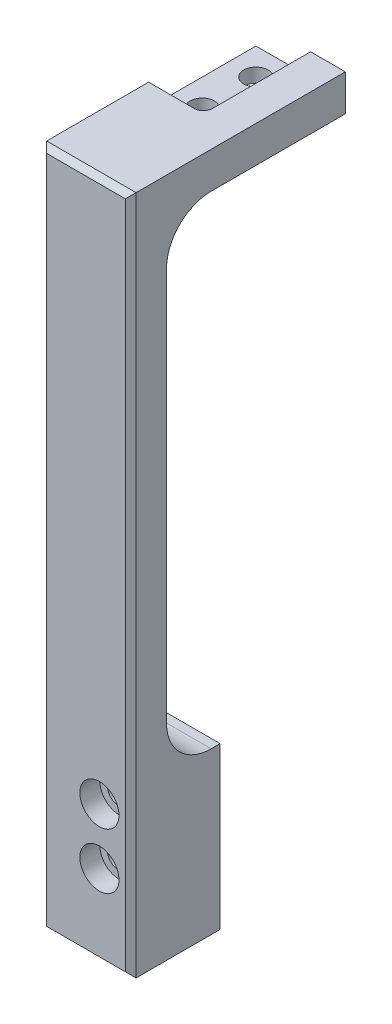
ISO-10303-21;
HEADER;
FILE_DESCRIPTION(('STEP AP214'),'2;1');
FILE_NAME('part.step','',(''),(''),'','','');
FILE_SCHEMA(('AUTOMOTIVE_DESIGN { 1 0 10303 214 1 1 1 1 }'));
ENDSEC;
DATA;
#1=APPLICATION_CONTEXT('core data for automotive mechanical design processes');
#2=APPLICATION_PROTOCOL_DEFINITION('international standard','automotive_design',2000,#1);
#3=PRODUCT_CONTEXT('',#1,'mechanical');
#4=PRODUCT('Part','Part','',(#3));
#5=PRODUCT_RELATED_PRODUCT_CATEGORY('part','',(#4));
#6=PRODUCT_DEFINITION_FORMATION('','',#4);
#7=PRODUCT_DEFINITION_CONTEXT('part definition',#1,'design');
#8=PRODUCT_DEFINITION('design','',#6,#7);
#9=PRODUCT_DEFINITION_SHAPE('','',#8);
#10=(LENGTH_UNIT() NAMED_UNIT(*) SI_UNIT(.MILLI.,.METRE.));
#11=(NAMED_UNIT(*) PLANE_ANGLE_UNIT() SI_UNIT($,.RADIAN.));
#12=(NAMED_UNIT(*) SI_UNIT($,.STERADIAN.) SOLID_ANGLE_UNIT());
#13=UNCERTAINTY_MEASURE_WITH_UNIT(LENGTH_MEASURE(1.E-05),#10,'distance_accuracy_value','');
#14=(GEOMETRIC_REPRESENTATION_CONTEXT(3) GLOBAL_UNCERTAINTY_ASSIGNED_CONTEXT((#13)) GLOBAL_UNIT_ASSIGNED_CONTEXT((#10,
#11,#12)) REPRESENTATION_CONTEXT('',''));
#15=CARTESIAN_POINT('',(0.,0.,0.));
#16=DIRECTION('',(0.,0.,1.));
#17=DIRECTION('',(1.,0.,0.));
#18=AXIS2_PLACEMENT_3D('',#15,#16,#17);
#19=CARTESIAN_POINT('',(3.81,0.,-13.97));
#20=DIRECTION('',(0.,1.,0.));
#21=DIRECTION('',(0.,0.,1.));
#22=AXIS2_PLACEMENT_3D('',#19,#20,#21);
#23=CYLINDRICAL_SURFACE('',#22,1.72719999999999);
#24=CARTESIAN_POINT('',(3.81,-5.16498089039687,-13.97));
#25=DIRECTION('',(0.,1.,0.));
#26=DIRECTION('',(0.,0.,1.));
#27=AXIS2_PLACEMENT_3D('',#24,#25,#26);
#28=CIRCLE('',#27,1.72719999999999);
#29=CARTESIAN_POINT('',(3.81,-5.16498089039687,-12.2428));
#30=VERTEX_POINT('',#29);
#31=EDGE_CURVE('E281',#30,#30,#28,.T.);
#32=ORIENTED_EDGE('',*,*,#31,.F.);
#33=EDGE_LOOP('',(#32));
#34=FACE_BOUND('',#33,.T.);
#35=CARTESIAN_POINT('',(3.81,-3.175,-13.97));
#36=DIRECTION('',(0.,1.,0.));
#37=DIRECTION('',(0.,0.,1.));
#38=AXIS2_PLACEMENT_3D('',#35,#36,#37);
#39=CIRCLE('',#38,1.72719999999999);
#40=CARTESIAN_POINT('',(3.81,-3.175,-12.2428));
#41=VERTEX_POINT('',#40);
#42=EDGE_CURVE('E256',#41,#41,#39,.F.);
#43=ORIENTED_EDGE('',*,*,#42,.F.);
#44=EDGE_LOOP('',(#43));
#45=FACE_BOUND('',#44,.T.);
#46=ADVANCED_FACE('F32',(#34,#45),#23,.F.);
#47=CARTESIAN_POINT('',(3.81,0.,-21.59));
#48=DIRECTION('',(0.,1.,0.));
#49=DIRECTION('',(0.,0.,1.));
#50=AXIS2_PLACEMENT_3D('',#47,#48,#49);
#51=CYLINDRICAL_SURFACE('',#50,1.72719999999999);
#52=CARTESIAN_POINT('',(3.81,-5.16498089039687,-21.59));
#53=DIRECTION('',(0.,1.,0.));
#54=DIRECTION('',(0.,0.,1.));
#55=AXIS2_PLACEMENT_3D('',#52,#53,#54);
#56=CIRCLE('',#55,1.72719999999999);
#57=CARTESIAN_POINT('',(3.81,-5.16498089039687,-19.8628));
#58=VERTEX_POINT('',#57);
#59=EDGE_CURVE('E280',#58,#58,#56,.T.);
#60=ORIENTED_EDGE('',*,*,#59,.F.);
#61=EDGE_LOOP('',(#60));
#62=FACE_BOUND('',#61,.T.);
#63=CARTESIAN_POINT('',(3.81,-3.175,-21.59));
#64=DIRECTION('',(0.,1.,0.));
#65=DIRECTION('',(0.,0.,1.));
#66=AXIS2_PLACEMENT_3D('',#63,#64,#65);
#67=CIRCLE('',#66,1.72719999999999);
#68=CARTESIAN_POINT('',(3.81,-3.175,-19.8628));
#69=VERTEX_POINT('',#68);
#70=EDGE_CURVE('E166',#69,#69,#67,.F.);
#71=ORIENTED_EDGE('',*,*,#70,.F.);
#72=EDGE_LOOP('',(#71));
#73=FACE_BOUND('',#72,.T.);
#74=ADVANCED_FACE('F329',(#62,#73),#51,.F.);
#75=CARTESIAN_POINT('',(0.,-96.5962,0.));
#76=DIRECTION('',(0.,0.,1.));
#77=DIRECTION('',(1.,0.,0.));
#78=AXIS2_PLACEMENT_3D('',#75,#76,#77);
#79=PLANE('',#78);
#80=DIRECTION('',(0.,-1.,0.));
#81=VECTOR('',#80,1.);
#82=CARTESIAN_POINT('',(0.,0.,0.));
#83=LINE('',#82,#81);
#84=CARTESIAN_POINT('',(0.,-11.5149808903969,0.));
#85=VERTEX_POINT('',#84);
#86=CARTESIAN_POINT('',(0.,-67.3862,0.));
#87=VERTEX_POINT('',#86);
#88=EDGE_CURVE('E185',#85,#87,#83,.T.);
#89=ORIENTED_EDGE('',*,*,#88,.F.);
#90=DIRECTION('',(-1.,0.,0.));
#91=VECTOR('',#90,1.);
#92=CARTESIAN_POINT('',(12.7,-11.5149808903969,0.));
#93=LINE('',#92,#91);
#94=CARTESIAN_POINT('',(12.7,-11.5149808903969,0.));
#95=VERTEX_POINT('',#94);
#96=EDGE_CURVE('E197',#85,#95,#93,.F.);
#97=ORIENTED_EDGE('',*,*,#96,.T.);
#98=DIRECTION('',(0.,1.,0.));
#99=VECTOR('',#98,1.);
#100=CARTESIAN_POINT('',(12.7,0.,0.));
#101=LINE('',#100,#99);
#102=CARTESIAN_POINT('',(12.7,-67.3862,0.));
#103=VERTEX_POINT('',#102);
#104=EDGE_CURVE('E189',#103,#95,#101,.T.);
#105=ORIENTED_EDGE('',*,*,#104,.F.);
#106=DIRECTION('',(1.,0.,0.));
#107=VECTOR('',#106,1.);
#108=CARTESIAN_POINT('',(0.,-67.3862,0.));
#109=LINE('',#108,#107);
#110=EDGE_CURVE('E195',#103,#87,#109,.F.);
#111=ORIENTED_EDGE('',*,*,#110,.T.);
#112=EDGE_LOOP('',(#89,#97,#105,#111));
#113=FACE_BOUND('',#112,.T.);
#114=ADVANCED_FACE('F335',(#113),#79,.F.);
#115=CARTESIAN_POINT('',(0.,0.,5.08));
#116=DIRECTION('',(1.,0.,0.));
#117=DIRECTION('',(0.,1.,0.));
#118=AXIS2_PLACEMENT_3D('',#115,#116,#117);
#119=PLANE('',#118);
#120=DIRECTION('',(0.,0.,-1.));
#121=VECTOR('',#120,1.);
#122=CARTESIAN_POINT('',(0.,-96.5962,5.08));
#123=LINE('',#122,#121);
#124=CARTESIAN_POINT('',(0.,-96.5962,4.318));
#125=VERTEX_POINT('',#124);
#126=CARTESIAN_POINT('',(0.,-96.5962,-7.62));
#127=VERTEX_POINT('',#126);
#128=EDGE_CURVE('E312',#125,#127,#123,.T.);
#129=ORIENTED_EDGE('',*,*,#128,.F.);
#130=DIRECTION('',(0.,1.,0.));
#131=VECTOR('',#130,1.);
#132=CARTESIAN_POINT('',(0.,0.,4.318));
#133=LINE('',#132,#131);
#134=CARTESIAN_POINT('',(0.,0.,4.318));
#135=VERTEX_POINT('',#134);
#136=EDGE_CURVE('E219',#125,#135,#133,.T.);
#137=ORIENTED_EDGE('',*,*,#136,.T.);
#138=DIRECTION('',(0.,0.,-1.));
#139=VECTOR('',#138,1.);
#140=CARTESIAN_POINT('',(0.,0.,5.08));
#141=LINE('',#140,#139);
#142=CARTESIAN_POINT('',(0.,0.,-10.16));
#143=VERTEX_POINT('',#142);
#144=EDGE_CURVE('E194',#135,#143,#141,.T.);
#145=ORIENTED_EDGE('',*,*,#144,.T.);
#146=DIRECTION('',(0.,-1.,0.));
#147=VECTOR('',#146,1.);
#148=CARTESIAN_POINT('',(0.,0.,-10.16));
#149=LINE('',#148,#147);
#150=CARTESIAN_POINT('',(0.,-3.175,-10.16));
#151=VERTEX_POINT('',#150);
#152=EDGE_CURVE('E261',#143,#151,#149,.T.);
#153=ORIENTED_EDGE('',*,*,#152,.T.);
#154=DIRECTION('',(0.,0.,1.));
#155=VECTOR('',#154,1.);
#156=CARTESIAN_POINT('',(0.,-3.175,5.08));
#157=LINE('',#156,#155);
#158=CARTESIAN_POINT('',(0.,-3.175,-25.4));
#159=VERTEX_POINT('',#158);
#160=EDGE_CURVE('E259',#159,#151,#157,.T.);
#161=ORIENTED_EDGE('',*,*,#160,.F.);
#162=DIRECTION('',(0.,1.,0.));
#163=VECTOR('',#162,1.);
#164=CARTESIAN_POINT('',(0.,0.,-25.4));
#165=LINE('',#164,#163);
#166=CARTESIAN_POINT('',(0.,-5.16498089039687,-25.4));
#167=VERTEX_POINT('',#166);
#168=EDGE_CURVE('E171',#167,#159,#165,.T.);
#169=ORIENTED_EDGE('',*,*,#168,.F.);
#170=DIRECTION('',(0.,0.,1.));
#171=VECTOR('',#170,1.);
#172=CARTESIAN_POINT('',(0.,-5.16498089039687,-25.4));
#173=LINE('',#172,#171);
#174=CARTESIAN_POINT('',(0.,-5.16498089039687,-6.35));
#175=VERTEX_POINT('',#174);
#176=EDGE_CURVE('E170',#167,#175,#173,.T.);
#177=ORIENTED_EDGE('',*,*,#176,.T.);
#178=CARTESIAN_POINT('',(0.,-11.5149808903969,-6.35));
#179=DIRECTION('',(1.,0.,0.));
#180=DIRECTION('',(0.,1.,0.));
#181=AXIS2_PLACEMENT_3D('',#178,#179,#180);
#182=CIRCLE('',#181,6.35);
#183=EDGE_CURVE('E202',#175,#85,#182,.T.);
#184=ORIENTED_EDGE('',*,*,#183,.T.);
#185=ORIENTED_EDGE('',*,*,#88,.T.);
#186=CARTESIAN_POINT('',(0.,-67.3862,-6.35));
#187=DIRECTION('',(1.,0.,0.));
#188=DIRECTION('',(0.,1.,0.));
#189=AXIS2_PLACEMENT_3D('',#186,#187,#188);
#190=CIRCLE('',#189,6.35);
#191=CARTESIAN_POINT('',(0.,-73.7362,-6.35));
#192=VERTEX_POINT('',#191);
#193=EDGE_CURVE('E208',#87,#192,#190,.T.);
#194=ORIENTED_EDGE('',*,*,#193,.T.);
#195=DIRECTION('',(0.,0.,1.));
#196=VECTOR('',#195,1.);
#197=CARTESIAN_POINT('',(0.,-73.7362,-7.62));
#198=LINE('',#197,#196);
#199=CARTESIAN_POINT('',(0.,-73.7362,-7.62));
#200=VERTEX_POINT('',#199);
#201=EDGE_CURVE('E277',#200,#192,#198,.T.);
#202=ORIENTED_EDGE('',*,*,#201,.F.);
#203=DIRECTION('',(0.,1.,0.));
#204=VECTOR('',#203,1.);
#205=CARTESIAN_POINT('',(0.,-96.5962,-7.62));
#206=LINE('',#205,#204);
#207=EDGE_CURVE('E270',#127,#200,#206,.T.);
#208=ORIENTED_EDGE('',*,*,#207,.F.);
#209=EDGE_LOOP('',(#129,#137,#145,#153,#161,#169,#177,#184,#185,#194,#202,#208));
#210=FACE_BOUND('',#209,.T.);
#211=ADVANCED_FACE('F296',(#210),#119,.F.);
#212=CARTESIAN_POINT('',(0.,-96.5962,5.08));
#213=DIRECTION('',(0.,1.,0.));
#214=DIRECTION('',(0.,0.,1.));
#215=AXIS2_PLACEMENT_3D('',#212,#213,#214);
#216=PLANE('',#215);
#217=DIRECTION('',(0.,0.,-1.));
#218=VECTOR('',#217,1.);
#219=CARTESIAN_POINT('',(12.7,-96.5962,5.08));
#220=LINE('',#219,#218);
#221=CARTESIAN_POINT('',(12.7,-96.5962,4.318));
#222=VERTEX_POINT('',#221);
#223=CARTESIAN_POINT('',(12.7,-96.5962,-7.62));
#224=VERTEX_POINT('',#223);
#225=EDGE_CURVE('E620',#222,#224,#220,.T.);
#226=ORIENTED_EDGE('',*,*,#225,.F.);
#227=DIRECTION('',(-1.,0.,0.));
#228=VECTOR('',#227,1.);
#229=CARTESIAN_POINT('',(0.,-96.5962,4.318));
#230=LINE('',#229,#228);
#231=EDGE_CURVE('E222',#222,#125,#230,.T.);
#232=ORIENTED_EDGE('',*,*,#231,.T.);
#233=ORIENTED_EDGE('',*,*,#128,.T.);
#234=DIRECTION('',(-1.,0.,0.));
#235=VECTOR('',#234,1.);
#236=CARTESIAN_POINT('',(12.7,-96.5962,-7.62));
#237=LINE('',#236,#235);
#238=EDGE_CURVE('E267',#224,#127,#237,.T.);
#239=ORIENTED_EDGE('',*,*,#238,.F.);
#240=EDGE_LOOP('',(#226,#232,#233,#239));
#241=FACE_BOUND('',#240,.T.);
#242=ADVANCED_FACE('F360',(#241),#216,.F.);
#243=CARTESIAN_POINT('',(12.7,0.,5.08));
#244=DIRECTION('',(-1.,0.,0.));
#245=DIRECTION('',(0.,-1.,0.));
#246=AXIS2_PLACEMENT_3D('',#243,#244,#245);
#247=PLANE('',#246);
#248=DIRECTION('',(0.,0.,-1.));
#249=VECTOR('',#248,1.);
#250=CARTESIAN_POINT('',(12.7,0.,5.08));
#251=LINE('',#250,#249);
#252=CARTESIAN_POINT('',(12.7,0.,4.318));
#253=VERTEX_POINT('',#252);
#254=CARTESIAN_POINT('',(12.7,0.,-25.4));
#255=VERTEX_POINT('',#254);
#256=EDGE_CURVE('E169',#253,#255,#251,.T.);
#257=ORIENTED_EDGE('',*,*,#256,.F.);
#258=DIRECTION('',(0.,-1.,0.));
#259=VECTOR('',#258,1.);
#260=CARTESIAN_POINT('',(12.7,-96.5962,4.318));
#261=LINE('',#260,#259);
#262=EDGE_CURVE('E41',#253,#222,#261,.T.);
#263=ORIENTED_EDGE('',*,*,#262,.T.);
#264=ORIENTED_EDGE('',*,*,#225,.T.);
#265=DIRECTION('',(0.,-1.,0.));
#266=VECTOR('',#265,1.);
#267=CARTESIAN_POINT('',(12.7,-96.5962,-7.62));
#268=LINE('',#267,#266);
#269=CARTESIAN_POINT('',(12.7,-73.7362,-7.62));
#270=VERTEX_POINT('',#269);
#271=EDGE_CURVE('E264',#270,#224,#268,.T.);
#272=ORIENTED_EDGE('',*,*,#271,.F.);
#273=DIRECTION('',(0.,0.,1.));
#274=VECTOR('',#273,1.);
#275=CARTESIAN_POINT('',(12.7,-73.7362,-7.62));
#276=LINE('',#275,#274);
#277=CARTESIAN_POINT('',(12.7,-73.7362,-6.35));
#278=VERTEX_POINT('',#277);
#279=EDGE_CURVE('E274',#270,#278,#276,.T.);
#280=ORIENTED_EDGE('',*,*,#279,.T.);
#281=CARTESIAN_POINT('',(12.7,-67.3862,-6.35));
#282=DIRECTION('',(-1.,0.,0.));
#283=DIRECTION('',(0.,-1.,0.));
#284=AXIS2_PLACEMENT_3D('',#281,#282,#283);
#285=CIRCLE('',#284,6.35);
#286=EDGE_CURVE('E206',#278,#103,#285,.T.);
#287=ORIENTED_EDGE('',*,*,#286,.T.);
#288=ORIENTED_EDGE('',*,*,#104,.T.);
#289=CARTESIAN_POINT('',(12.7,-11.5149808903969,-6.35));
#290=DIRECTION('',(-1.,0.,0.));
#291=DIRECTION('',(0.,-1.,0.));
#292=AXIS2_PLACEMENT_3D('',#289,#290,#291);
#293=CIRCLE('',#292,6.35);
#294=CARTESIAN_POINT('',(12.7,-5.16498089039687,-6.35));
#295=VERTEX_POINT('',#294);
#296=EDGE_CURVE('E204',#95,#295,#293,.T.);
#297=ORIENTED_EDGE('',*,*,#296,.T.);
#298=DIRECTION('',(0.,0.,1.));
#299=VECTOR('',#298,1.);
#300=CARTESIAN_POINT('',(12.7,-5.16498089039687,-25.4));
#301=LINE('',#300,#299);
#302=CARTESIAN_POINT('',(12.7,-5.16498089039687,-25.4));
#303=VERTEX_POINT('',#302);
#304=EDGE_CURVE('E174',#303,#295,#301,.T.);
#305=ORIENTED_EDGE('',*,*,#304,.F.);
#306=DIRECTION('',(0.,-1.,0.));
#307=VECTOR('',#306,1.);
#308=CARTESIAN_POINT('',(12.7,0.,-25.4));
#309=LINE('',#308,#307);
#310=EDGE_CURVE('E284',#255,#303,#309,.T.);
#311=ORIENTED_EDGE('',*,*,#310,.F.);
#312=EDGE_LOOP('',(#257,#263,#264,#272,#280,#287,#288,#297,#305,#311));
#313=FACE_BOUND('',#312,.T.);
#314=ADVANCED_FACE('F357',(#313),#247,.F.);
#315=CARTESIAN_POINT('',(0.,0.,5.08));
#316=DIRECTION('',(0.,-1.,0.));
#317=DIRECTION('',(0.,0.,-1.));
#318=AXIS2_PLACEMENT_3D('',#315,#316,#317);
#319=PLANE('',#318);
#320=ORIENTED_EDGE('',*,*,#144,.F.);
#321=DIRECTION('',(1.,0.,0.));
#322=VECTOR('',#321,1.);
#323=CARTESIAN_POINT('',(12.7,0.,4.318));
#324=LINE('',#323,#322);
#325=EDGE_CURVE('E11',#135,#253,#324,.T.);
#326=ORIENTED_EDGE('',*,*,#325,.T.);
#327=ORIENTED_EDGE('',*,*,#256,.T.);
#328=DIRECTION('',(1.,0.,0.));
#329=VECTOR('',#328,1.);
#330=CARTESIAN_POINT('',(12.7,0.,-25.4));
#331=LINE('',#330,#329);
#332=CARTESIAN_POINT('',(7.7724,0.,-25.4));
#333=VERTEX_POINT('',#332);
#334=EDGE_CURVE('E162',#333,#255,#331,.T.);
#335=ORIENTED_EDGE('',*,*,#334,.F.);
#336=DIRECTION('',(0.,0.,-1.));
#337=VECTOR('',#336,1.);
#338=CARTESIAN_POINT('',(7.7724,0.,-25.4));
#339=LINE('',#338,#337);
#340=CARTESIAN_POINT('',(7.7724,0.,-11.43));
#341=VERTEX_POINT('',#340);
#342=EDGE_CURVE('E146',#341,#333,#339,.T.);
#343=ORIENTED_EDGE('',*,*,#342,.F.);
#344=CARTESIAN_POINT('',(6.5024,0.,-11.43));
#345=DIRECTION('',(0.,-1.,0.));
#346=DIRECTION('',(0.,0.,-1.));
#347=AXIS2_PLACEMENT_3D('',#344,#345,#346);
#348=CIRCLE('',#347,1.27);
#349=CARTESIAN_POINT('',(6.5024,0.,-10.16));
#350=VERTEX_POINT('',#349);
#351=EDGE_CURVE('E310',#341,#350,#348,.T.);
#352=ORIENTED_EDGE('',*,*,#351,.T.);
#353=DIRECTION('',(1.,0.,0.));
#354=VECTOR('',#353,1.);
#355=CARTESIAN_POINT('',(-0.1524,0.,-10.16));
#356=LINE('',#355,#354);
#357=EDGE_CURVE('E156',#143,#350,#356,.T.);
#358=ORIENTED_EDGE('',*,*,#357,.F.);
#359=EDGE_LOOP('',(#320,#326,#327,#335,#343,#352,#358));
#360=FACE_BOUND('',#359,.T.);
#361=ADVANCED_FACE('F168',(#360),#319,.F.);
#362=CARTESIAN_POINT('',(0.,-96.5962,5.08));
#363=DIRECTION('',(0.,0.,1.));
#364=DIRECTION('',(1.,0.,0.));
#365=AXIS2_PLACEMENT_3D('',#362,#363,#364);
#366=PLANE('',#365);
#367=CARTESIAN_POINT('',(8.25500000000002,-84.9717808903969,5.08));
#368=DIRECTION('',(0.,0.,1.));
#369=DIRECTION('',(1.,0.,0.));
#370=AXIS2_PLACEMENT_3D('',#367,#368,#369);
#371=CIRCLE('',#370,2.77875999999999);
#372=CARTESIAN_POINT('',(11.03376,-84.9717808903969,5.08));
#373=VERTEX_POINT('',#372);
#374=EDGE_CURVE('E602',#373,#373,#371,.T.);
#375=ORIENTED_EDGE('',*,*,#374,.F.);
#376=EDGE_LOOP('',(#375));
#377=FACE_BOUND('',#376,.T.);
#378=CARTESIAN_POINT('',(8.25500000000003,-77.0469808903969,5.08));
#379=DIRECTION('',(0.,0.,1.));
#380=DIRECTION('',(1.,0.,0.));
#381=AXIS2_PLACEMENT_3D('',#378,#379,#380);
#382=CIRCLE('',#381,2.77875999999999);
#383=CARTESIAN_POINT('',(11.03376,-77.0469808903969,5.08));
#384=VERTEX_POINT('',#383);
#385=EDGE_CURVE('E245',#384,#384,#382,.T.);
#386=ORIENTED_EDGE('',*,*,#385,.F.);
#387=EDGE_LOOP('',(#386));
#388=FACE_BOUND('',#387,.T.);
#389=DIRECTION('',(-1.,0.,0.));
#390=VECTOR('',#389,1.);
#391=CARTESIAN_POINT('',(0.,-0.761999999999999,5.08));
#392=LINE('',#391,#390);
#393=CARTESIAN_POINT('',(11.938,-0.761999999999999,5.08));
#394=VERTEX_POINT('',#393);
#395=CARTESIAN_POINT('',(0.761999999999999,-0.761999999999999,5.08));
#396=VERTEX_POINT('',#395);
#397=EDGE_CURVE('E210',#394,#396,#392,.T.);
#398=ORIENTED_EDGE('',*,*,#397,.T.);
#399=DIRECTION('',(0.,-1.,0.));
#400=VECTOR('',#399,1.);
#401=CARTESIAN_POINT('',(0.762000000000011,-96.5962,5.08));
#402=LINE('',#401,#400);
#403=CARTESIAN_POINT('',(0.76200000000001,-95.8342,5.08));
#404=VERTEX_POINT('',#403);
#405=EDGE_CURVE('E216',#396,#404,#402,.T.);
#406=ORIENTED_EDGE('',*,*,#405,.T.);
#407=DIRECTION('',(1.,0.,0.));
#408=VECTOR('',#407,1.);
#409=CARTESIAN_POINT('',(12.7,-95.8342,5.08));
#410=LINE('',#409,#408);
#411=CARTESIAN_POINT('',(11.938,-95.8342,5.08));
#412=VERTEX_POINT('',#411);
#413=EDGE_CURVE('E214',#404,#412,#410,.T.);
#414=ORIENTED_EDGE('',*,*,#413,.T.);
#415=DIRECTION('',(0.,1.,0.));
#416=VECTOR('',#415,1.);
#417=CARTESIAN_POINT('',(11.938,0.,5.08));
#418=LINE('',#417,#416);
#419=EDGE_CURVE('E212',#412,#394,#418,.T.);
#420=ORIENTED_EDGE('',*,*,#419,.T.);
#421=EDGE_LOOP('',(#398,#406,#414,#420));
#422=FACE_BOUND('',#421,.T.);
#423=ADVANCED_FACE('F347',(#377,#388,#422),#366,.T.);
#424=CARTESIAN_POINT('',(12.7,-5.16498089039687,-25.4));
#425=DIRECTION('',(0.,1.,0.));
#426=DIRECTION('',(0.,0.,1.));
#427=AXIS2_PLACEMENT_3D('',#424,#425,#426);
#428=PLANE('',#427);
#429=ORIENTED_EDGE('',*,*,#59,.T.);
#430=EDGE_LOOP('',(#429));
#431=FACE_BOUND('',#430,.T.);
#432=ORIENTED_EDGE('',*,*,#31,.T.);
#433=EDGE_LOOP('',(#432));
#434=FACE_BOUND('',#433,.T.);
#435=ORIENTED_EDGE('',*,*,#304,.T.);
#436=DIRECTION('',(-1.,0.,0.));
#437=VECTOR('',#436,1.);
#438=CARTESIAN_POINT('',(0.,-5.16498089039687,-6.35));
#439=LINE('',#438,#437);
#440=EDGE_CURVE('E190',#295,#175,#439,.T.);
#441=ORIENTED_EDGE('',*,*,#440,.T.);
#442=ORIENTED_EDGE('',*,*,#176,.F.);
#443=DIRECTION('',(-1.,0.,0.));
#444=VECTOR('',#443,1.);
#445=CARTESIAN_POINT('',(12.7,-5.16498089039687,-25.4));
#446=LINE('',#445,#444);
#447=EDGE_CURVE('E176',#303,#167,#446,.T.);
#448=ORIENTED_EDGE('',*,*,#447,.F.);
#449=EDGE_LOOP('',(#435,#441,#442,#448));
#450=FACE_BOUND('',#449,.T.);
#451=ADVANCED_FACE('F291',(#431,#434,#450),#428,.F.);
#452=CARTESIAN_POINT('',(12.7,-5.16498089039687,-25.4));
#453=DIRECTION('',(0.,0.,-1.));
#454=DIRECTION('',(-1.,0.,0.));
#455=AXIS2_PLACEMENT_3D('',#452,#453,#454);
#456=PLANE('',#455);
#457=DIRECTION('',(0.,1.,0.));
#458=VECTOR('',#457,1.);
#459=CARTESIAN_POINT('',(7.7724,-3.175,-25.4));
#460=LINE('',#459,#458);
#461=CARTESIAN_POINT('',(7.7724,-3.175,-25.4));
#462=VERTEX_POINT('',#461);
#463=EDGE_CURVE('E150',#462,#333,#460,.T.);
#464=ORIENTED_EDGE('',*,*,#463,.T.);
#465=ORIENTED_EDGE('',*,*,#334,.T.);
#466=ORIENTED_EDGE('',*,*,#310,.T.);
#467=ORIENTED_EDGE('',*,*,#447,.T.);
#468=ORIENTED_EDGE('',*,*,#168,.T.);
#469=DIRECTION('',(-1.,0.,0.));
#470=VECTOR('',#469,1.);
#471=CARTESIAN_POINT('',(-0.152400000000001,-3.175,-25.4));
#472=LINE('',#471,#470);
#473=EDGE_CURVE('E165',#462,#159,#472,.T.);
#474=ORIENTED_EDGE('',*,*,#473,.F.);
#475=EDGE_LOOP('',(#464,#465,#466,#467,#468,#474));
#476=FACE_BOUND('',#475,.T.);
#477=ADVANCED_FACE('F160',(#476),#456,.T.);
#478=CARTESIAN_POINT('',(12.7,-73.7362,-7.62));
#479=DIRECTION('',(0.,-1.,0.));
#480=DIRECTION('',(0.,0.,-1.));
#481=AXIS2_PLACEMENT_3D('',#478,#479,#480);
#482=PLANE('',#481);
#483=ORIENTED_EDGE('',*,*,#201,.T.);
#484=DIRECTION('',(1.,0.,0.));
#485=VECTOR('',#484,1.);
#486=CARTESIAN_POINT('',(12.7,-73.7362,-6.35));
#487=LINE('',#486,#485);
#488=EDGE_CURVE('E199',#192,#278,#487,.T.);
#489=ORIENTED_EDGE('',*,*,#488,.T.);
#490=ORIENTED_EDGE('',*,*,#279,.F.);
#491=DIRECTION('',(1.,0.,0.));
#492=VECTOR('',#491,1.);
#493=CARTESIAN_POINT('',(12.7,-73.7362,-7.62));
#494=LINE('',#493,#492);
#495=EDGE_CURVE('E272',#200,#270,#494,.T.);
#496=ORIENTED_EDGE('',*,*,#495,.F.);
#497=EDGE_LOOP('',(#483,#489,#490,#496));
#498=FACE_BOUND('',#497,.T.);
#499=ADVANCED_FACE('F344',(#498),#482,.F.);
#500=CARTESIAN_POINT('',(12.7,-73.7362,-7.62));
#501=DIRECTION('',(0.,0.,1.));
#502=DIRECTION('',(1.,0.,0.));
#503=AXIS2_PLACEMENT_3D('',#500,#501,#502);
#504=PLANE('',#503);
#505=CARTESIAN_POINT('',(8.25500000000002,-84.9717808903969,-7.62));
#506=DIRECTION('',(0.,0.,1.));
#507=DIRECTION('',(1.,0.,0.));
#508=AXIS2_PLACEMENT_3D('',#505,#506,#507);
#509=CIRCLE('',#508,1.7272);
#510=CARTESIAN_POINT('',(9.98220000000002,-84.9717808903969,-7.62));
#511=VERTEX_POINT('',#510);
#512=EDGE_CURVE('E36',#511,#511,#509,.T.);
#513=ORIENTED_EDGE('',*,*,#512,.T.);
#514=EDGE_LOOP('',(#513));
#515=FACE_BOUND('',#514,.T.);
#516=CARTESIAN_POINT('',(8.25500000000003,-77.0469808903969,-7.62));
#517=DIRECTION('',(0.,0.,1.));
#518=DIRECTION('',(1.,0.,0.));
#519=AXIS2_PLACEMENT_3D('',#516,#517,#518);
#520=CIRCLE('',#519,1.7272);
#521=CARTESIAN_POINT('',(9.98220000000003,-77.0469808903969,-7.62));
#522=VERTEX_POINT('',#521);
#523=EDGE_CURVE('E228',#522,#522,#520,.T.);
#524=ORIENTED_EDGE('',*,*,#523,.T.);
#525=EDGE_LOOP('',(#524));
#526=FACE_BOUND('',#525,.T.);
#527=ORIENTED_EDGE('',*,*,#271,.T.);
#528=ORIENTED_EDGE('',*,*,#238,.T.);
#529=ORIENTED_EDGE('',*,*,#207,.T.);
#530=ORIENTED_EDGE('',*,*,#495,.T.);
#531=EDGE_LOOP('',(#527,#528,#529,#530));
#532=FACE_BOUND('',#531,.T.);
#533=ADVANCED_FACE('F404',(#515,#526,#532),#504,.F.);
#534=CARTESIAN_POINT('',(-0.1524,-3.175,-10.16));
#535=DIRECTION('',(0.,0.,1.));
#536=DIRECTION('',(1.,0.,0.));
#537=AXIS2_PLACEMENT_3D('',#534,#535,#536);
#538=PLANE('',#537);
#539=ORIENTED_EDGE('',*,*,#357,.T.);
#540=DIRECTION('',(0.,1.,0.));
#541=VECTOR('',#540,1.);
#542=CARTESIAN_POINT('',(6.5024,-3.175,-10.16));
#543=LINE('',#542,#541);
#544=CARTESIAN_POINT('',(6.5024,-3.175,-10.16));
#545=VERTEX_POINT('',#544);
#546=EDGE_CURVE('E306',#350,#545,#543,.F.);
#547=ORIENTED_EDGE('',*,*,#546,.T.);
#548=DIRECTION('',(1.,0.,0.));
#549=VECTOR('',#548,1.);
#550=CARTESIAN_POINT('',(-0.1524,-3.175,-10.16));
#551=LINE('',#550,#549);
#552=EDGE_CURVE('E155',#151,#545,#551,.T.);
#553=ORIENTED_EDGE('',*,*,#552,.F.);
#554=ORIENTED_EDGE('',*,*,#152,.F.);
#555=EDGE_LOOP('',(#539,#547,#553,#554));
#556=FACE_BOUND('',#555,.T.);
#557=ADVANCED_FACE('F303',(#556),#538,.F.);
#558=CARTESIAN_POINT('',(-0.1524,-3.175,-10.16));
#559=DIRECTION('',(0.,1.,0.));
#560=DIRECTION('',(0.,0.,1.));
#561=AXIS2_PLACEMENT_3D('',#558,#559,#560);
#562=PLANE('',#561);
#563=ORIENTED_EDGE('',*,*,#42,.T.);
#564=EDGE_LOOP('',(#563));
#565=FACE_BOUND('',#564,.T.);
#566=ORIENTED_EDGE('',*,*,#70,.T.);
#567=EDGE_LOOP('',(#566));
#568=FACE_BOUND('',#567,.T.);
#569=ORIENTED_EDGE('',*,*,#552,.T.);
#570=CARTESIAN_POINT('',(6.5024,-3.175,-11.43));
#571=DIRECTION('',(0.,1.,0.));
#572=DIRECTION('',(0.,0.,1.));
#573=AXIS2_PLACEMENT_3D('',#570,#571,#572);
#574=CIRCLE('',#573,1.27);
#575=CARTESIAN_POINT('',(7.7724,-3.175,-11.43));
#576=VERTEX_POINT('',#575);
#577=EDGE_CURVE('E308',#545,#576,#574,.T.);
#578=ORIENTED_EDGE('',*,*,#577,.T.);
#579=DIRECTION('',(0.,0.,-1.));
#580=VECTOR('',#579,1.);
#581=CARTESIAN_POINT('',(7.7724,-3.175,-25.4));
#582=LINE('',#581,#580);
#583=EDGE_CURVE('E251',#576,#462,#582,.T.);
#584=ORIENTED_EDGE('',*,*,#583,.T.);
#585=ORIENTED_EDGE('',*,*,#473,.T.);
#586=ORIENTED_EDGE('',*,*,#160,.T.);
#587=EDGE_LOOP('',(#569,#578,#584,#585,#586));
#588=FACE_BOUND('',#587,.T.);
#589=ADVANCED_FACE('F300',(#565,#568,#588),#562,.T.);
#590=CARTESIAN_POINT('',(7.7724,-3.175,-25.4));
#591=DIRECTION('',(1.,0.,0.));
#592=DIRECTION('',(0.,0.,-1.));
#593=AXIS2_PLACEMENT_3D('',#590,#591,#592);
#594=PLANE('',#593);
#595=ORIENTED_EDGE('',*,*,#583,.F.);
#596=DIRECTION('',(0.,1.,0.));
#597=VECTOR('',#596,1.);
#598=CARTESIAN_POINT('',(7.7724,0.,-11.43));
#599=LINE('',#598,#597);
#600=EDGE_CURVE('E153',#576,#341,#599,.T.);
#601=ORIENTED_EDGE('',*,*,#600,.T.);
#602=ORIENTED_EDGE('',*,*,#342,.T.);
#603=ORIENTED_EDGE('',*,*,#463,.F.);
#604=EDGE_LOOP('',(#595,#601,#602,#603));
#605=FACE_BOUND('',#604,.T.);
#606=ADVANCED_FACE('F149',(#605),#594,.F.);
#607=CARTESIAN_POINT('',(6.5024,-3.175,-11.43));
#608=DIRECTION('',(0.,-1.,0.));
#609=DIRECTION('',(0.,0.,-1.));
#610=AXIS2_PLACEMENT_3D('',#607,#608,#609);
#611=CYLINDRICAL_SURFACE('',#610,1.27);
#612=ORIENTED_EDGE('',*,*,#577,.F.);
#613=ORIENTED_EDGE('',*,*,#546,.F.);
#614=ORIENTED_EDGE('',*,*,#351,.F.);
#615=ORIENTED_EDGE('',*,*,#600,.F.);
#616=EDGE_LOOP('',(#612,#613,#614,#615));
#617=FACE_BOUND('',#616,.T.);
#618=ADVANCED_FACE('F315',(#617),#611,.F.);
#619=CARTESIAN_POINT('',(12.7,-11.5149808903969,-6.35));
#620=DIRECTION('',(1.,0.,0.));
#621=DIRECTION('',(0.,0.,-1.));
#622=AXIS2_PLACEMENT_3D('',#619,#620,#621);
#623=CYLINDRICAL_SURFACE('',#622,6.35);
#624=ORIENTED_EDGE('',*,*,#296,.F.);
#625=ORIENTED_EDGE('',*,*,#96,.F.);
#626=ORIENTED_EDGE('',*,*,#183,.F.);
#627=ORIENTED_EDGE('',*,*,#440,.F.);
#628=EDGE_LOOP('',(#624,#625,#626,#627));
#629=FACE_BOUND('',#628,.T.);
#630=ADVANCED_FACE('F317',(#629),#623,.F.);
#631=CARTESIAN_POINT('',(12.7,-67.3862,-6.35));
#632=DIRECTION('',(-1.,0.,0.));
#633=DIRECTION('',(0.,0.,1.));
#634=AXIS2_PLACEMENT_3D('',#631,#632,#633);
#635=CYLINDRICAL_SURFACE('',#634,6.35);
#636=ORIENTED_EDGE('',*,*,#193,.F.);
#637=ORIENTED_EDGE('',*,*,#110,.F.);
#638=ORIENTED_EDGE('',*,*,#286,.F.);
#639=ORIENTED_EDGE('',*,*,#488,.F.);
#640=EDGE_LOOP('',(#636,#637,#638,#639));
#641=FACE_BOUND('',#640,.T.);
#642=ADVANCED_FACE('F323',(#641),#635,.F.);
#643=CARTESIAN_POINT('',(11.938,-96.5962,5.08));
#644=DIRECTION('',(0.707106781186548,0.,0.707106781186548));
#645=DIRECTION('',(0.707106781186548,0.,-0.707106781186548));
#646=AXIS2_PLACEMENT_3D('',#643,#644,#645);
#647=PLANE('',#646);
#648=DIRECTION('',(0.577350269189626,-0.577350269189626,-0.577350269189626));
#649=VECTOR('',#648,1.);
#650=CARTESIAN_POINT('',(12.192,-96.0882,4.826));
#651=LINE('',#650,#649);
#652=EDGE_CURVE('E230',#222,#412,#651,.F.);
#653=ORIENTED_EDGE('',*,*,#652,.F.);
#654=ORIENTED_EDGE('',*,*,#262,.F.);
#655=DIRECTION('',(0.577350269189626,0.577350269189626,-0.577350269189626));
#656=VECTOR('',#655,1.);
#657=CARTESIAN_POINT('',(7.95866666666667,-4.74133333333333,9.05933333333333));
#658=LINE('',#657,#656);
#659=EDGE_CURVE('E233',#394,#253,#658,.T.);
#660=ORIENTED_EDGE('',*,*,#659,.F.);
#661=ORIENTED_EDGE('',*,*,#419,.F.);
#662=EDGE_LOOP('',(#653,#654,#660,#661));
#663=FACE_BOUND('',#662,.T.);
#664=ADVANCED_FACE('F34',(#663),#647,.T.);
#665=CARTESIAN_POINT('',(0.,-0.761999999999999,5.08));
#666=DIRECTION('',(0.,0.707106781186548,0.707106781186548));
#667=DIRECTION('',(0.,-0.707106781186548,0.707106781186548));
#668=AXIS2_PLACEMENT_3D('',#665,#666,#667);
#669=PLANE('',#668);
#670=ORIENTED_EDGE('',*,*,#659,.T.);
#671=ORIENTED_EDGE('',*,*,#325,.F.);
#672=DIRECTION('',(0.577350269189626,-0.577350269189626,0.577350269189626));
#673=VECTOR('',#672,1.);
#674=CARTESIAN_POINT('',(0.508000000000003,-0.508000000000003,4.826));
#675=LINE('',#674,#673);
#676=EDGE_CURVE('E227',#396,#135,#675,.F.);
#677=ORIENTED_EDGE('',*,*,#676,.F.);
#678=ORIENTED_EDGE('',*,*,#397,.F.);
#679=EDGE_LOOP('',(#670,#671,#677,#678));
#680=FACE_BOUND('',#679,.T.);
#681=ADVANCED_FACE('F506',(#680),#669,.T.);
#682=CARTESIAN_POINT('',(0.,-95.8342,5.08));
#683=DIRECTION('',(0.,-0.707106781186548,0.707106781186548));
#684=DIRECTION('',(0.,-0.707106781186548,-0.707106781186548));
#685=AXIS2_PLACEMENT_3D('',#682,#683,#684);
#686=PLANE('',#685);
#687=ORIENTED_EDGE('',*,*,#652,.T.);
#688=ORIENTED_EDGE('',*,*,#413,.F.);
#689=DIRECTION('',(-0.577350269189626,-0.577350269189626,-0.577350269189626));
#690=VECTOR('',#689,1.);
#691=CARTESIAN_POINT('',(0.508000000000011,-96.0882,4.826));
#692=LINE('',#691,#690);
#693=EDGE_CURVE('E225',#125,#404,#692,.F.);
#694=ORIENTED_EDGE('',*,*,#693,.F.);
#695=ORIENTED_EDGE('',*,*,#231,.F.);
#696=EDGE_LOOP('',(#687,#688,#694,#695));
#697=FACE_BOUND('',#696,.T.);
#698=ADVANCED_FACE('F514',(#697),#686,.T.);
#699=CARTESIAN_POINT('',(0.762000000000011,-96.5962,5.08));
#700=DIRECTION('',(-0.707106781186548,0.,0.707106781186548));
#701=DIRECTION('',(0.707106781186548,0.,0.707106781186548));
#702=AXIS2_PLACEMENT_3D('',#699,#700,#701);
#703=PLANE('',#702);
#704=ORIENTED_EDGE('',*,*,#676,.T.);
#705=ORIENTED_EDGE('',*,*,#136,.F.);
#706=ORIENTED_EDGE('',*,*,#693,.T.);
#707=ORIENTED_EDGE('',*,*,#405,.F.);
#708=EDGE_LOOP('',(#704,#705,#706,#707));
#709=FACE_BOUND('',#708,.T.);
#710=ADVANCED_FACE('F522',(#709),#703,.T.);
#711=CARTESIAN_POINT('',(8.25500000000003,-77.0469808903969,5.08));
#712=DIRECTION('',(0.,0.,1.));
#713=DIRECTION('',(1.,0.,0.));
#714=AXIS2_PLACEMENT_3D('',#711,#712,#713);
#715=CYLINDRICAL_SURFACE('',#714,1.7272);
#716=CARTESIAN_POINT('',(8.25500000000003,-77.0469808903969,2.2352));
#717=DIRECTION('',(0.,0.,1.));
#718=DIRECTION('',(1.,0.,0.));
#719=AXIS2_PLACEMENT_3D('',#716,#717,#718);
#720=CIRCLE('',#719,1.72720000000001);
#721=CARTESIAN_POINT('',(9.98220000000004,-77.0469808903969,2.2352));
#722=VERTEX_POINT('',#721);
#723=EDGE_CURVE('E236',#722,#722,#720,.T.);
#724=ORIENTED_EDGE('',*,*,#723,.T.);
#725=EDGE_LOOP('',(#724));
#726=FACE_BOUND('',#725,.T.);
#727=ORIENTED_EDGE('',*,*,#523,.F.);
#728=EDGE_LOOP('',(#727));
#729=FACE_BOUND('',#728,.T.);
#730=ADVANCED_FACE('F530',(#726,#729),#715,.F.);
#731=CARTESIAN_POINT('',(9.98220000000004,-77.0469808903969,2.2352));
#732=DIRECTION('',(0.,0.,-1.));
#733=DIRECTION('',(-1.,0.,0.));
#734=AXIS2_PLACEMENT_3D('',#731,#732,#733);
#735=PLANE('',#734);
#736=ORIENTED_EDGE('',*,*,#723,.F.);
#737=EDGE_LOOP('',(#736));
#738=FACE_BOUND('',#737,.T.);
#739=CARTESIAN_POINT('',(8.25500000000003,-77.0469808903969,2.2352));
#740=DIRECTION('',(0.,0.,1.));
#741=DIRECTION('',(1.,0.,0.));
#742=AXIS2_PLACEMENT_3D('',#739,#740,#741);
#743=CIRCLE('',#742,2.77875999999999);
#744=CARTESIAN_POINT('',(11.03376,-77.0469808903969,2.2352));
#745=VERTEX_POINT('',#744);
#746=EDGE_CURVE('E240',#745,#745,#743,.T.);
#747=ORIENTED_EDGE('',*,*,#746,.T.);
#748=EDGE_LOOP('',(#747));
#749=FACE_BOUND('',#748,.T.);
#750=ADVANCED_FACE('F538',(#738,#749),#735,.F.);
#751=CARTESIAN_POINT('',(8.25500000000003,-77.0469808903969,5.08));
#752=DIRECTION('',(0.,0.,1.));
#753=DIRECTION('',(1.,0.,0.));
#754=AXIS2_PLACEMENT_3D('',#751,#752,#753);
#755=CYLINDRICAL_SURFACE('',#754,2.77875999999999);
#756=ORIENTED_EDGE('',*,*,#746,.F.);
#757=EDGE_LOOP('',(#756));
#758=FACE_BOUND('',#757,.T.);
#759=ORIENTED_EDGE('',*,*,#385,.T.);
#760=EDGE_LOOP('',(#759));
#761=FACE_BOUND('',#760,.T.);
#762=ADVANCED_FACE('F546',(#758,#761),#755,.F.);
#763=CARTESIAN_POINT('',(8.25500000000002,-84.9717808903969,5.08));
#764=DIRECTION('',(0.,0.,1.));
#765=DIRECTION('',(1.,0.,0.));
#766=AXIS2_PLACEMENT_3D('',#763,#764,#765);
#767=CYLINDRICAL_SURFACE('',#766,1.7272);
#768=CARTESIAN_POINT('',(8.25500000000002,-84.9717808903969,2.2352));
#769=DIRECTION('',(0.,0.,1.));
#770=DIRECTION('',(1.,0.,0.));
#771=AXIS2_PLACEMENT_3D('',#768,#769,#770);
#772=CIRCLE('',#771,1.72720000000001);
#773=CARTESIAN_POINT('',(9.98220000000003,-84.9717808903969,2.2352));
#774=VERTEX_POINT('',#773);
#775=EDGE_CURVE('E604',#774,#774,#772,.T.);
#776=ORIENTED_EDGE('',*,*,#775,.T.);
#777=EDGE_LOOP('',(#776));
#778=FACE_BOUND('',#777,.T.);
#779=ORIENTED_EDGE('',*,*,#512,.F.);
#780=EDGE_LOOP('',(#779));
#781=FACE_BOUND('',#780,.T.);
#782=ADVANCED_FACE('F555',(#778,#781),#767,.F.);
#783=CARTESIAN_POINT('',(9.98220000000003,-84.9717808903969,2.2352));
#784=DIRECTION('',(0.,0.,-1.));
#785=DIRECTION('',(-1.,0.,0.));
#786=AXIS2_PLACEMENT_3D('',#783,#784,#785);
#787=PLANE('',#786);
#788=ORIENTED_EDGE('',*,*,#775,.F.);
#789=EDGE_LOOP('',(#788));
#790=FACE_BOUND('',#789,.T.);
#791=CARTESIAN_POINT('',(8.25500000000002,-84.9717808903969,2.2352));
#792=DIRECTION('',(0.,0.,1.));
#793=DIRECTION('',(1.,0.,0.));
#794=AXIS2_PLACEMENT_3D('',#791,#792,#793);
#795=CIRCLE('',#794,2.77875999999999);
#796=CARTESIAN_POINT('',(11.03376,-84.9717808903969,2.2352));
#797=VERTEX_POINT('',#796);
#798=EDGE_CURVE('E599',#797,#797,#795,.T.);
#799=ORIENTED_EDGE('',*,*,#798,.T.);
#800=EDGE_LOOP('',(#799));
#801=FACE_BOUND('',#800,.T.);
#802=ADVANCED_FACE('F564',(#790,#801),#787,.F.);
#803=CARTESIAN_POINT('',(8.25500000000002,-84.9717808903969,5.08));
#804=DIRECTION('',(0.,0.,1.));
#805=DIRECTION('',(1.,0.,0.));
#806=AXIS2_PLACEMENT_3D('',#803,#804,#805);
#807=CYLINDRICAL_SURFACE('',#806,2.77875999999999);
#808=ORIENTED_EDGE('',*,*,#798,.F.);
#809=EDGE_LOOP('',(#808));
#810=FACE_BOUND('',#809,.T.);
#811=ORIENTED_EDGE('',*,*,#374,.T.);
#812=EDGE_LOOP('',(#811));
#813=FACE_BOUND('',#812,.T.);
#814=ADVANCED_FACE('F573',(#810,#813),#807,.F.);
#815=CLOSED_SHELL('',(#46,#74,#114,#211,#242,#314,#361,#423,#451,#477,#499,#533,#557,#589,#606,
#618,#630,#642,#664,#681,#698,#710,#730,#750,#762,#782,#802,#814));
#816=MANIFOLD_SOLID_BREP('B2',#815);
#817=ADVANCED_BREP_SHAPE_REPRESENTATION('',(#18,#816),#14);
#818=SHAPE_DEFINITION_REPRESENTATION(#9,#817);
ENDSEC;
END-ISO-10303-21;
